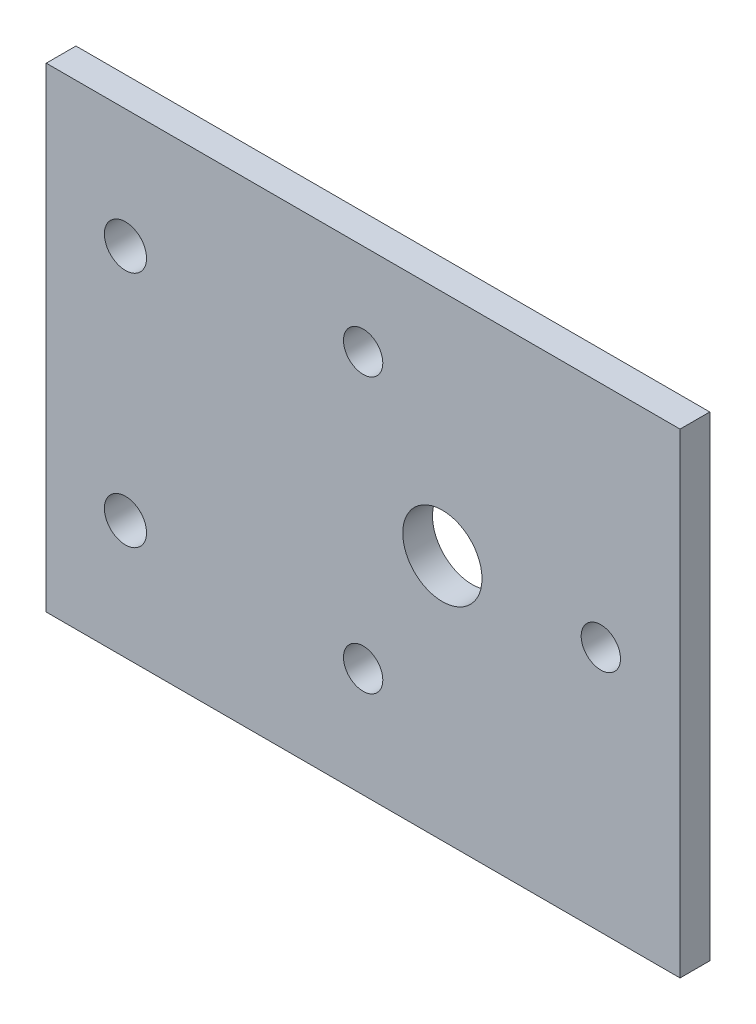
ISO-10303-21;
HEADER;
FILE_DESCRIPTION(('STEP AP214'),'2;1');
FILE_NAME('part.step','',(''),(''),'','','');
FILE_SCHEMA(('AUTOMOTIVE_DESIGN { 1 0 10303 214 1 1 1 1 }'));
ENDSEC;
DATA;
#1=APPLICATION_CONTEXT('core data for automotive mechanical design processes');
#2=APPLICATION_PROTOCOL_DEFINITION('international standard','automotive_design',2000,#1);
#3=PRODUCT_CONTEXT('',#1,'mechanical');
#4=PRODUCT('Part','Part','',(#3));
#5=PRODUCT_RELATED_PRODUCT_CATEGORY('part','',(#4));
#6=PRODUCT_DEFINITION_FORMATION('','',#4);
#7=PRODUCT_DEFINITION_CONTEXT('part definition',#1,'design');
#8=PRODUCT_DEFINITION('design','',#6,#7);
#9=PRODUCT_DEFINITION_SHAPE('','',#8);
#10=(LENGTH_UNIT() NAMED_UNIT(*) SI_UNIT(.MILLI.,.METRE.));
#11=(NAMED_UNIT(*) PLANE_ANGLE_UNIT() SI_UNIT($,.RADIAN.));
#12=(NAMED_UNIT(*) SI_UNIT($,.STERADIAN.) SOLID_ANGLE_UNIT());
#13=UNCERTAINTY_MEASURE_WITH_UNIT(LENGTH_MEASURE(1.E-05),#10,'distance_accuracy_value','');
#14=(GEOMETRIC_REPRESENTATION_CONTEXT(3) GLOBAL_UNCERTAINTY_ASSIGNED_CONTEXT((#13)) GLOBAL_UNIT_ASSIGNED_CONTEXT((#10,
#11,#12)) REPRESENTATION_CONTEXT('',''));
#15=CARTESIAN_POINT('',(0.,0.,0.));
#16=DIRECTION('',(0.,0.,1.));
#17=DIRECTION('',(1.,0.,0.));
#18=AXIS2_PLACEMENT_3D('',#15,#16,#17);
#19=CARTESIAN_POINT('',(0.,76.2,4.7625));
#20=DIRECTION('',(1.,0.,0.));
#21=DIRECTION('',(0.,0.,-1.));
#22=AXIS2_PLACEMENT_3D('',#19,#20,#21);
#23=PLANE('',#22);
#24=DIRECTION('',(0.,-1.,0.));
#25=VECTOR('',#24,1.);
#26=CARTESIAN_POINT('',(0.,76.2,0.));
#27=LINE('',#26,#25);
#28=CARTESIAN_POINT('',(0.,76.2,0.));
#29=VERTEX_POINT('',#28);
#30=CARTESIAN_POINT('',(0.,0.,0.));
#31=VERTEX_POINT('',#30);
#32=EDGE_CURVE('E95',#29,#31,#27,.T.);
#33=ORIENTED_EDGE('',*,*,#32,.T.);
#34=DIRECTION('',(0.,0.,-1.));
#35=VECTOR('',#34,1.);
#36=CARTESIAN_POINT('',(0.,0.,4.7625));
#37=LINE('',#36,#35);
#38=CARTESIAN_POINT('',(0.,0.,4.7625));
#39=VERTEX_POINT('',#38);
#40=EDGE_CURVE('E11',#39,#31,#37,.T.);
#41=ORIENTED_EDGE('',*,*,#40,.F.);
#42=DIRECTION('',(0.,-1.,0.));
#43=VECTOR('',#42,1.);
#44=CARTESIAN_POINT('',(0.,76.2,4.7625));
#45=LINE('',#44,#43);
#46=CARTESIAN_POINT('',(0.,76.2,4.7625));
#47=VERTEX_POINT('',#46);
#48=EDGE_CURVE('E83',#47,#39,#45,.T.);
#49=ORIENTED_EDGE('',*,*,#48,.F.);
#50=DIRECTION('',(0.,0.,-1.));
#51=VECTOR('',#50,1.);
#52=CARTESIAN_POINT('',(0.,76.2,4.7625));
#53=LINE('',#52,#51);
#54=EDGE_CURVE('E91',#47,#29,#53,.T.);
#55=ORIENTED_EDGE('',*,*,#54,.T.);
#56=EDGE_LOOP('',(#33,#41,#49,#55));
#57=FACE_BOUND('',#56,.T.);
#58=ADVANCED_FACE('F32',(#57),#23,.F.);
#59=CARTESIAN_POINT('',(0.,0.,4.7625));
#60=DIRECTION('',(0.,1.,0.));
#61=DIRECTION('',(0.,0.,1.));
#62=AXIS2_PLACEMENT_3D('',#59,#60,#61);
#63=PLANE('',#62);
#64=DIRECTION('',(1.,0.,0.));
#65=VECTOR('',#64,1.);
#66=CARTESIAN_POINT('',(0.,0.,0.));
#67=LINE('',#66,#65);
#68=CARTESIAN_POINT('',(101.6,0.,0.));
#69=VERTEX_POINT('',#68);
#70=EDGE_CURVE('E87',#31,#69,#67,.T.);
#71=ORIENTED_EDGE('',*,*,#70,.T.);
#72=DIRECTION('',(0.,0.,-1.));
#73=VECTOR('',#72,1.);
#74=CARTESIAN_POINT('',(101.6,0.,4.7625));
#75=LINE('',#74,#73);
#76=CARTESIAN_POINT('',(101.6,0.,4.7625));
#77=VERTEX_POINT('',#76);
#78=EDGE_CURVE('E40',#77,#69,#75,.T.);
#79=ORIENTED_EDGE('',*,*,#78,.F.);
#80=DIRECTION('',(1.,0.,0.));
#81=VECTOR('',#80,1.);
#82=CARTESIAN_POINT('',(0.,0.,4.7625));
#83=LINE('',#82,#81);
#84=EDGE_CURVE('E78',#39,#77,#83,.T.);
#85=ORIENTED_EDGE('',*,*,#84,.F.);
#86=ORIENTED_EDGE('',*,*,#40,.T.);
#87=EDGE_LOOP('',(#71,#79,#85,#86));
#88=FACE_BOUND('',#87,.T.);
#89=ADVANCED_FACE('F86',(#88),#63,.F.);
#90=CARTESIAN_POINT('',(101.6,0.,4.7625));
#91=DIRECTION('',(-1.,0.,0.));
#92=DIRECTION('',(0.,0.,1.));
#93=AXIS2_PLACEMENT_3D('',#90,#91,#92);
#94=PLANE('',#93);
#95=DIRECTION('',(0.,1.,0.));
#96=VECTOR('',#95,1.);
#97=CARTESIAN_POINT('',(101.6,0.,0.));
#98=LINE('',#97,#96);
#99=CARTESIAN_POINT('',(101.6,76.2,0.));
#100=VERTEX_POINT('',#99);
#101=EDGE_CURVE('E65',#69,#100,#98,.T.);
#102=ORIENTED_EDGE('',*,*,#101,.T.);
#103=DIRECTION('',(0.,0.,-1.));
#104=VECTOR('',#103,1.);
#105=CARTESIAN_POINT('',(101.6,76.2,4.7625));
#106=LINE('',#105,#104);
#107=CARTESIAN_POINT('',(101.6,76.2,4.7625));
#108=VERTEX_POINT('',#107);
#109=EDGE_CURVE('E88',#108,#100,#106,.T.);
#110=ORIENTED_EDGE('',*,*,#109,.F.);
#111=DIRECTION('',(0.,1.,0.));
#112=VECTOR('',#111,1.);
#113=CARTESIAN_POINT('',(101.6,0.,4.7625));
#114=LINE('',#113,#112);
#115=EDGE_CURVE('E81',#77,#108,#114,.T.);
#116=ORIENTED_EDGE('',*,*,#115,.F.);
#117=ORIENTED_EDGE('',*,*,#78,.T.);
#118=EDGE_LOOP('',(#102,#110,#116,#117));
#119=FACE_BOUND('',#118,.T.);
#120=ADVANCED_FACE('F89',(#119),#94,.F.);
#121=CARTESIAN_POINT('',(101.6,76.2,4.7625));
#122=DIRECTION('',(0.,-1.,0.));
#123=DIRECTION('',(1.,0.,0.));
#124=AXIS2_PLACEMENT_3D('',#121,#122,#123);
#125=PLANE('',#124);
#126=DIRECTION('',(-1.,0.,0.));
#127=VECTOR('',#126,1.);
#128=CARTESIAN_POINT('',(101.6,76.2,0.));
#129=LINE('',#128,#127);
#130=EDGE_CURVE('E71',#100,#29,#129,.T.);
#131=ORIENTED_EDGE('',*,*,#130,.T.);
#132=ORIENTED_EDGE('',*,*,#54,.F.);
#133=DIRECTION('',(-1.,0.,0.));
#134=VECTOR('',#133,1.);
#135=CARTESIAN_POINT('',(101.6,76.2,4.7625));
#136=LINE('',#135,#134);
#137=EDGE_CURVE('E48',#108,#47,#136,.T.);
#138=ORIENTED_EDGE('',*,*,#137,.F.);
#139=ORIENTED_EDGE('',*,*,#109,.T.);
#140=EDGE_LOOP('',(#131,#132,#138,#139));
#141=FACE_BOUND('',#140,.T.);
#142=ADVANCED_FACE('F103',(#141),#125,.F.);
#143=CARTESIAN_POINT('',(0.,0.,4.7625));
#144=DIRECTION('',(0.,0.,1.));
#145=DIRECTION('',(1.,0.,0.));
#146=AXIS2_PLACEMENT_3D('',#143,#144,#145);
#147=PLANE('',#146);
#148=CARTESIAN_POINT('',(50.8,17.5498317487821,4.7625));
#149=DIRECTION('',(0.,0.,1.));
#150=DIRECTION('',(1.,0.,0.));
#151=AXIS2_PLACEMENT_3D('',#148,#149,#150);
#152=CIRCLE('',#151,3.1500064);
#153=CARTESIAN_POINT('',(53.9500064,17.5498317487821,4.7625));
#154=VERTEX_POINT('',#153);
#155=EDGE_CURVE('E127',#154,#154,#152,.T.);
#156=ORIENTED_EDGE('',*,*,#155,.F.);
#157=EDGE_LOOP('',(#156));
#158=FACE_BOUND('',#157,.T.);
#159=CARTESIAN_POINT('',(88.8999999999999,39.5468770049069,4.7625));
#160=DIRECTION('',(0.,0.,1.));
#161=DIRECTION('',(1.,0.,0.));
#162=AXIS2_PLACEMENT_3D('',#159,#160,#161);
#163=CIRCLE('',#162,3.1500064);
#164=CARTESIAN_POINT('',(92.0500063999999,39.5468770049069,4.7625));
#165=VERTEX_POINT('',#164);
#166=EDGE_CURVE('E133',#165,#165,#163,.T.);
#167=ORIENTED_EDGE('',*,*,#166,.F.);
#168=EDGE_LOOP('',(#167));
#169=FACE_BOUND('',#168,.T.);
#170=CARTESIAN_POINT('',(50.7999999999999,61.5439222610316,4.7625));
#171=DIRECTION('',(0.,0.,1.));
#172=DIRECTION('',(1.,0.,0.));
#173=AXIS2_PLACEMENT_3D('',#170,#171,#172);
#174=CIRCLE('',#173,3.1500064);
#175=CARTESIAN_POINT('',(53.9500063999999,61.5439222610316,4.7625));
#176=VERTEX_POINT('',#175);
#177=EDGE_CURVE('E139',#176,#176,#174,.T.);
#178=ORIENTED_EDGE('',*,*,#177,.F.);
#179=EDGE_LOOP('',(#178));
#180=FACE_BOUND('',#179,.T.);
#181=CARTESIAN_POINT('',(63.5,39.5468770049069,4.7625));
#182=DIRECTION('',(0.,0.,1.));
#183=DIRECTION('',(1.,0.,0.));
#184=AXIS2_PLACEMENT_3D('',#181,#182,#183);
#185=CIRCLE('',#184,6.35);
#186=CARTESIAN_POINT('',(69.85,39.5468770049069,4.7625));
#187=VERTEX_POINT('',#186);
#188=EDGE_CURVE('E121',#187,#187,#185,.T.);
#189=ORIENTED_EDGE('',*,*,#188,.F.);
#190=EDGE_LOOP('',(#189));
#191=FACE_BOUND('',#190,.T.);
#192=CARTESIAN_POINT('',(12.7,57.15,4.7625));
#193=DIRECTION('',(0.,0.,1.));
#194=DIRECTION('',(1.,0.,0.));
#195=AXIS2_PLACEMENT_3D('',#192,#193,#194);
#196=CIRCLE('',#195,3.3782);
#197=CARTESIAN_POINT('',(16.0782,57.15,4.7625));
#198=VERTEX_POINT('',#197);
#199=EDGE_CURVE('E116',#198,#198,#196,.T.);
#200=ORIENTED_EDGE('',*,*,#199,.F.);
#201=EDGE_LOOP('',(#200));
#202=FACE_BOUND('',#201,.T.);
#203=CARTESIAN_POINT('',(12.7,19.05,4.7625));
#204=DIRECTION('',(0.,0.,1.));
#205=DIRECTION('',(1.,0.,0.));
#206=AXIS2_PLACEMENT_3D('',#203,#204,#205);
#207=CIRCLE('',#206,3.3782);
#208=CARTESIAN_POINT('',(16.0782,19.05,4.7625));
#209=VERTEX_POINT('',#208);
#210=EDGE_CURVE('E109',#209,#209,#207,.T.);
#211=ORIENTED_EDGE('',*,*,#210,.F.);
#212=EDGE_LOOP('',(#211));
#213=FACE_BOUND('',#212,.T.);
#214=ORIENTED_EDGE('',*,*,#48,.T.);
#215=ORIENTED_EDGE('',*,*,#84,.T.);
#216=ORIENTED_EDGE('',*,*,#115,.T.);
#217=ORIENTED_EDGE('',*,*,#137,.T.);
#218=EDGE_LOOP('',(#214,#215,#216,#217));
#219=FACE_BOUND('',#218,.T.);
#220=ADVANCED_FACE('F79',(#158,#169,#180,#191,#202,#213,#219),#147,.T.);
#221=CARTESIAN_POINT('',(0.,0.,0.));
#222=DIRECTION('',(0.,0.,1.));
#223=DIRECTION('',(1.,0.,0.));
#224=AXIS2_PLACEMENT_3D('',#221,#222,#223);
#225=PLANE('',#224);
#226=CARTESIAN_POINT('',(50.8,17.5498317487821,0.));
#227=DIRECTION('',(0.,0.,1.));
#228=DIRECTION('',(1.,0.,0.));
#229=AXIS2_PLACEMENT_3D('',#226,#227,#228);
#230=CIRCLE('',#229,3.1500064);
#231=CARTESIAN_POINT('',(53.9500064,17.5498317487821,0.));
#232=VERTEX_POINT('',#231);
#233=EDGE_CURVE('E130',#232,#232,#230,.T.);
#234=ORIENTED_EDGE('',*,*,#233,.T.);
#235=EDGE_LOOP('',(#234));
#236=FACE_BOUND('',#235,.T.);
#237=CARTESIAN_POINT('',(88.8999999999999,39.5468770049069,0.));
#238=DIRECTION('',(0.,0.,1.));
#239=DIRECTION('',(1.,0.,0.));
#240=AXIS2_PLACEMENT_3D('',#237,#238,#239);
#241=CIRCLE('',#240,3.1500064);
#242=CARTESIAN_POINT('',(92.0500063999999,39.5468770049069,0.));
#243=VERTEX_POINT('',#242);
#244=EDGE_CURVE('E136',#243,#243,#241,.T.);
#245=ORIENTED_EDGE('',*,*,#244,.T.);
#246=EDGE_LOOP('',(#245));
#247=FACE_BOUND('',#246,.T.);
#248=CARTESIAN_POINT('',(50.7999999999999,61.5439222610316,0.));
#249=DIRECTION('',(0.,0.,1.));
#250=DIRECTION('',(1.,0.,0.));
#251=AXIS2_PLACEMENT_3D('',#248,#249,#250);
#252=CIRCLE('',#251,3.1500064);
#253=CARTESIAN_POINT('',(53.9500063999999,61.5439222610316,0.));
#254=VERTEX_POINT('',#253);
#255=EDGE_CURVE('E124',#254,#254,#252,.T.);
#256=ORIENTED_EDGE('',*,*,#255,.T.);
#257=EDGE_LOOP('',(#256));
#258=FACE_BOUND('',#257,.T.);
#259=CARTESIAN_POINT('',(63.5,39.5468770049069,0.));
#260=DIRECTION('',(0.,0.,1.));
#261=DIRECTION('',(1.,0.,0.));
#262=AXIS2_PLACEMENT_3D('',#259,#260,#261);
#263=CIRCLE('',#262,6.35);
#264=CARTESIAN_POINT('',(69.85,39.5468770049069,0.));
#265=VERTEX_POINT('',#264);
#266=EDGE_CURVE('E113',#265,#265,#263,.T.);
#267=ORIENTED_EDGE('',*,*,#266,.T.);
#268=EDGE_LOOP('',(#267));
#269=FACE_BOUND('',#268,.T.);
#270=CARTESIAN_POINT('',(12.7,57.15,0.));
#271=DIRECTION('',(0.,0.,1.));
#272=DIRECTION('',(1.,0.,0.));
#273=AXIS2_PLACEMENT_3D('',#270,#271,#272);
#274=CIRCLE('',#273,3.3782);
#275=CARTESIAN_POINT('',(16.0782,57.15,0.));
#276=VERTEX_POINT('',#275);
#277=EDGE_CURVE('E98',#276,#276,#274,.T.);
#278=ORIENTED_EDGE('',*,*,#277,.T.);
#279=EDGE_LOOP('',(#278));
#280=FACE_BOUND('',#279,.T.);
#281=CARTESIAN_POINT('',(12.7,19.05,0.));
#282=DIRECTION('',(0.,0.,1.));
#283=DIRECTION('',(1.,0.,0.));
#284=AXIS2_PLACEMENT_3D('',#281,#282,#283);
#285=CIRCLE('',#284,3.3782);
#286=CARTESIAN_POINT('',(16.0782,19.05,0.));
#287=VERTEX_POINT('',#286);
#288=EDGE_CURVE('E112',#287,#287,#285,.T.);
#289=ORIENTED_EDGE('',*,*,#288,.T.);
#290=EDGE_LOOP('',(#289));
#291=FACE_BOUND('',#290,.T.);
#292=ORIENTED_EDGE('',*,*,#32,.F.);
#293=ORIENTED_EDGE('',*,*,#130,.F.);
#294=ORIENTED_EDGE('',*,*,#101,.F.);
#295=ORIENTED_EDGE('',*,*,#70,.F.);
#296=EDGE_LOOP('',(#292,#293,#294,#295));
#297=FACE_BOUND('',#296,.T.);
#298=ADVANCED_FACE('F106',(#236,#247,#258,#269,#280,#291,#297),#225,.F.);
#299=CARTESIAN_POINT('',(12.7,19.05,0.));
#300=DIRECTION('',(0.,0.,1.));
#301=DIRECTION('',(1.,0.,0.));
#302=AXIS2_PLACEMENT_3D('',#299,#300,#301);
#303=CYLINDRICAL_SURFACE('',#302,3.3782);
#304=ORIENTED_EDGE('',*,*,#288,.F.);
#305=EDGE_LOOP('',(#304));
#306=FACE_BOUND('',#305,.T.);
#307=ORIENTED_EDGE('',*,*,#210,.T.);
#308=EDGE_LOOP('',(#307));
#309=FACE_BOUND('',#308,.T.);
#310=ADVANCED_FACE('F165',(#306,#309),#303,.F.);
#311=CARTESIAN_POINT('',(12.7,57.15,0.));
#312=DIRECTION('',(0.,0.,1.));
#313=DIRECTION('',(1.,0.,0.));
#314=AXIS2_PLACEMENT_3D('',#311,#312,#313);
#315=CYLINDRICAL_SURFACE('',#314,3.3782);
#316=ORIENTED_EDGE('',*,*,#277,.F.);
#317=EDGE_LOOP('',(#316));
#318=FACE_BOUND('',#317,.T.);
#319=ORIENTED_EDGE('',*,*,#199,.T.);
#320=EDGE_LOOP('',(#319));
#321=FACE_BOUND('',#320,.T.);
#322=ADVANCED_FACE('F167',(#318,#321),#315,.F.);
#323=CARTESIAN_POINT('',(63.5,39.5468770049069,0.));
#324=DIRECTION('',(0.,0.,1.));
#325=DIRECTION('',(1.,0.,0.));
#326=AXIS2_PLACEMENT_3D('',#323,#324,#325);
#327=CYLINDRICAL_SURFACE('',#326,6.35);
#328=ORIENTED_EDGE('',*,*,#266,.F.);
#329=EDGE_LOOP('',(#328));
#330=FACE_BOUND('',#329,.T.);
#331=ORIENTED_EDGE('',*,*,#188,.T.);
#332=EDGE_LOOP('',(#331));
#333=FACE_BOUND('',#332,.T.);
#334=ADVANCED_FACE('F151',(#330,#333),#327,.F.);
#335=CARTESIAN_POINT('',(50.7999999999999,61.5439222610316,0.));
#336=DIRECTION('',(0.,0.,1.));
#337=DIRECTION('',(1.,0.,0.));
#338=AXIS2_PLACEMENT_3D('',#335,#336,#337);
#339=CYLINDRICAL_SURFACE('',#338,3.1500064);
#340=ORIENTED_EDGE('',*,*,#255,.F.);
#341=EDGE_LOOP('',(#340));
#342=FACE_BOUND('',#341,.T.);
#343=ORIENTED_EDGE('',*,*,#177,.T.);
#344=EDGE_LOOP('',(#343));
#345=FACE_BOUND('',#344,.T.);
#346=ADVANCED_FACE('F147',(#342,#345),#339,.F.);
#347=CARTESIAN_POINT('',(88.8999999999999,39.5468770049069,0.));
#348=DIRECTION('',(0.,0.,1.));
#349=DIRECTION('',(1.,0.,0.));
#350=AXIS2_PLACEMENT_3D('',#347,#348,#349);
#351=CYLINDRICAL_SURFACE('',#350,3.1500064);
#352=ORIENTED_EDGE('',*,*,#244,.F.);
#353=EDGE_LOOP('',(#352));
#354=FACE_BOUND('',#353,.T.);
#355=ORIENTED_EDGE('',*,*,#166,.T.);
#356=EDGE_LOOP('',(#355));
#357=FACE_BOUND('',#356,.T.);
#358=ADVANCED_FACE('F150',(#354,#357),#351,.F.);
#359=CARTESIAN_POINT('',(50.8,17.5498317487821,0.));
#360=DIRECTION('',(0.,0.,1.));
#361=DIRECTION('',(1.,0.,0.));
#362=AXIS2_PLACEMENT_3D('',#359,#360,#361);
#363=CYLINDRICAL_SURFACE('',#362,3.1500064);
#364=ORIENTED_EDGE('',*,*,#233,.F.);
#365=EDGE_LOOP('',(#364));
#366=FACE_BOUND('',#365,.T.);
#367=ORIENTED_EDGE('',*,*,#155,.T.);
#368=EDGE_LOOP('',(#367));
#369=FACE_BOUND('',#368,.T.);
#370=ADVANCED_FACE('F228',(#366,#369),#363,.F.);
#371=CLOSED_SHELL('',(#58,#89,#120,#142,#220,#298,#310,#322,#334,#346,#358,#370));
#372=MANIFOLD_SOLID_BREP('B2',#371);
#373=ADVANCED_BREP_SHAPE_REPRESENTATION('',(#18,#372),#14);
#374=SHAPE_DEFINITION_REPRESENTATION(#9,#373);
ENDSEC;
END-ISO-10303-21;
